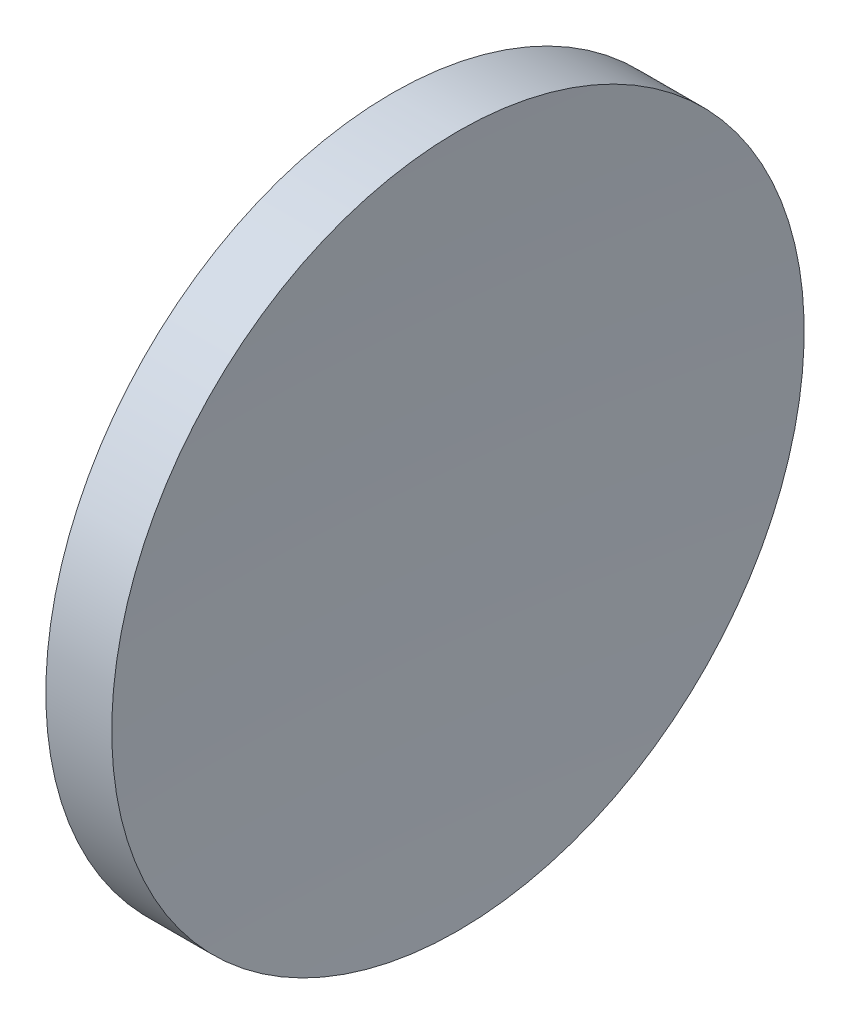
ISO-10303-21;
HEADER;
FILE_DESCRIPTION(('STEP AP214'),'2;1');
FILE_NAME('part.step','',(''),(''),'','','');
FILE_SCHEMA(('AUTOMOTIVE_DESIGN { 1 0 10303 214 1 1 1 1 }'));
ENDSEC;
DATA;
#1=APPLICATION_CONTEXT('core data for automotive mechanical design processes');
#2=APPLICATION_PROTOCOL_DEFINITION('international standard','automotive_design',2000,#1);
#3=PRODUCT_CONTEXT('',#1,'mechanical');
#4=PRODUCT('Part','Part','',(#3));
#5=PRODUCT_RELATED_PRODUCT_CATEGORY('part','',(#4));
#6=PRODUCT_DEFINITION_FORMATION('','',#4);
#7=PRODUCT_DEFINITION_CONTEXT('part definition',#1,'design');
#8=PRODUCT_DEFINITION('design','',#6,#7);
#9=PRODUCT_DEFINITION_SHAPE('','',#8);
#10=(LENGTH_UNIT() NAMED_UNIT(*) SI_UNIT(.MILLI.,.METRE.));
#11=(NAMED_UNIT(*) PLANE_ANGLE_UNIT() SI_UNIT($,.RADIAN.));
#12=(NAMED_UNIT(*) SI_UNIT($,.STERADIAN.) SOLID_ANGLE_UNIT());
#13=UNCERTAINTY_MEASURE_WITH_UNIT(LENGTH_MEASURE(1.E-05),#10,'distance_accuracy_value','');
#14=(GEOMETRIC_REPRESENTATION_CONTEXT(3) GLOBAL_UNCERTAINTY_ASSIGNED_CONTEXT((#13)) GLOBAL_UNIT_ASSIGNED_CONTEXT((#10,
#11,#12)) REPRESENTATION_CONTEXT('',''));
#15=CARTESIAN_POINT('',(0.,0.,0.));
#16=DIRECTION('',(0.,0.,1.));
#17=DIRECTION('',(1.,0.,0.));
#18=AXIS2_PLACEMENT_3D('',#15,#16,#17);
#19=CARTESIAN_POINT('',(265.458190158021,32.5787259132929,0.));
#20=DIRECTION('',(-1.,0.,0.));
#21=DIRECTION('',(0.,1.,0.));
#22=AXIS2_PLACEMENT_3D('',#19,#20,#21);
#23=SPHERICAL_SURFACE('',#22,206.1);
#24=CARTESIAN_POINT('',(59.7376029529482,32.5787259132931,0.));
#25=DIRECTION('',(-1.,0.,0.));
#26=DIRECTION('',(0.,-1.,0.));
#27=AXIS2_PLACEMENT_3D('',#24,#25,#26);
#28=CIRCLE('',#27,12.5);
#29=CARTESIAN_POINT('',(59.7376029529482,20.0787259132931,0.));
#30=VERTEX_POINT('',#29);
#31=EDGE_CURVE('E10',#30,#30,#28,.T.);
#32=ORIENTED_EDGE('',*,*,#31,.F.);
#33=EDGE_LOOP('',(#32));
#34=FACE_BOUND('',#33,.T.);
#35=ADVANCED_FACE('F35',(#34),#23,.F.);
#36=CARTESIAN_POINT('',(55.0073946244212,32.5787259132931,0.));
#37=DIRECTION('',(-1.,0.,0.));
#38=DIRECTION('',(0.,-1.,0.));
#39=AXIS2_PLACEMENT_3D('',#36,#37,#38);
#40=CYLINDRICAL_SURFACE('',#39,12.5);
#41=CARTESIAN_POINT('',(57.3581901580211,32.5787259132931,0.));
#42=DIRECTION('',(-1.,0.,0.));
#43=DIRECTION('',(0.,-1.,0.));
#44=AXIS2_PLACEMENT_3D('',#41,#42,#43);
#45=CIRCLE('',#44,12.5);
#46=CARTESIAN_POINT('',(57.3581901580211,20.0787259132931,0.));
#47=VERTEX_POINT('',#46);
#48=EDGE_CURVE('E41',#47,#47,#45,.T.);
#49=ORIENTED_EDGE('',*,*,#48,.F.);
#50=EDGE_LOOP('',(#49));
#51=FACE_BOUND('',#50,.T.);
#52=ORIENTED_EDGE('',*,*,#31,.T.);
#53=EDGE_LOOP('',(#52));
#54=FACE_BOUND('',#53,.T.);
#55=ADVANCED_FACE('F49',(#51,#54),#40,.T.);
#56=CARTESIAN_POINT('',(57.3581901580211,32.5787259132931,0.));
#57=DIRECTION('',(1.,0.,0.));
#58=DIRECTION('',(0.,1.,0.));
#59=AXIS2_PLACEMENT_3D('',#56,#57,#58);
#60=PLANE('',#59);
#61=ORIENTED_EDGE('',*,*,#48,.T.);
#62=EDGE_LOOP('',(#61));
#63=FACE_BOUND('',#62,.T.);
#64=ADVANCED_FACE('F47',(#63),#60,.F.);
#65=CLOSED_SHELL('',(#35,#55,#64));
#66=MANIFOLD_SOLID_BREP('B2',#65);
#67=ADVANCED_BREP_SHAPE_REPRESENTATION('',(#18,#66),#14);
#68=SHAPE_DEFINITION_REPRESENTATION(#9,#67);
ENDSEC;
END-ISO-10303-21;
